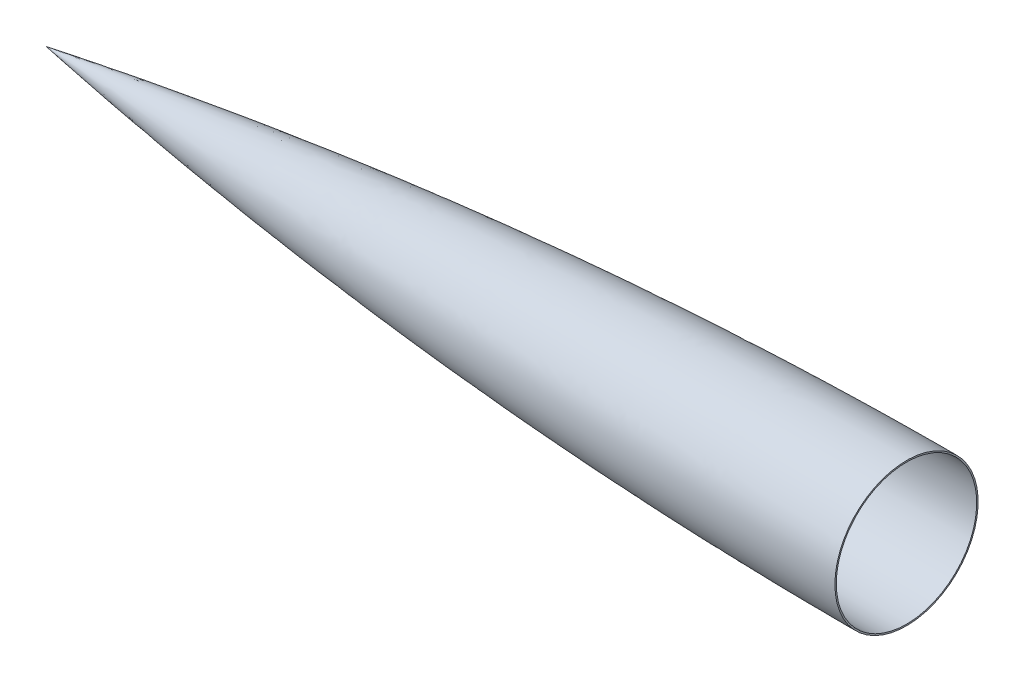
ISO-10303-21;
HEADER;
FILE_DESCRIPTION(('STEP AP214'),'2;1');
FILE_NAME('part.step','',(''),(''),'','','');
FILE_SCHEMA(('AUTOMOTIVE_DESIGN { 1 0 10303 214 1 1 1 1 }'));
ENDSEC;
DATA;
#1=APPLICATION_CONTEXT('core data for automotive mechanical design processes');
#2=APPLICATION_PROTOCOL_DEFINITION('international standard','automotive_design',2000,#1);
#3=PRODUCT_CONTEXT('',#1,'mechanical');
#4=PRODUCT('Part','Part','',(#3));
#5=PRODUCT_RELATED_PRODUCT_CATEGORY('part','',(#4));
#6=PRODUCT_DEFINITION_FORMATION('','',#4);
#7=PRODUCT_DEFINITION_CONTEXT('part definition',#1,'design');
#8=PRODUCT_DEFINITION('design','',#6,#7);
#9=PRODUCT_DEFINITION_SHAPE('','',#8);
#10=(LENGTH_UNIT() NAMED_UNIT(*) SI_UNIT(.MILLI.,.METRE.));
#11=(NAMED_UNIT(*) PLANE_ANGLE_UNIT() SI_UNIT($,.RADIAN.));
#12=(NAMED_UNIT(*) SI_UNIT($,.STERADIAN.) SOLID_ANGLE_UNIT());
#13=UNCERTAINTY_MEASURE_WITH_UNIT(LENGTH_MEASURE(1.E-05),#10,'distance_accuracy_value','');
#14=(GEOMETRIC_REPRESENTATION_CONTEXT(3) GLOBAL_UNCERTAINTY_ASSIGNED_CONTEXT((#13)) GLOBAL_UNIT_ASSIGNED_CONTEXT((#10,
#11,#12)) REPRESENTATION_CONTEXT('',''));
#15=CARTESIAN_POINT('',(0.,0.,0.));
#16=DIRECTION('',(0.,0.,1.));
#17=DIRECTION('',(1.,0.,0.));
#18=AXIS2_PLACEMENT_3D('',#15,#16,#17);
#19=CARTESIAN_POINT('',(1038.78316632407,0.,-3651.63596350947));
#20=DIRECTION('',(0.,-1.,0.));
#21=DIRECTION('',(0.,0.,1.));
#22=AXIS2_PLACEMENT_3D('',#19,#20,#21);
#23=CIRCLE('',#22,3702.58836350947);
#24=TRIMMED_CURVE('',#23,(PARAMETER_VALUE(-0.16609016004747)),
(PARAMETER_VALUE(0.16609016004747)),.T.,.PARAMETER.);
#25=CARTESIAN_POINT('',(1038.78316632407,0.,0.));
#26=DIRECTION('',(-1.,0.,0.));
#27=AXIS1_PLACEMENT('',#25,#26);
#28=SURFACE_OF_REVOLUTION('',#24,#27);
#29=CARTESIAN_POINT('',(426.643166324074,0.,0.));
#30=VERTEX_POINT('',#29);
#31=VERTEX_LOOP('',#30);
#32=FACE_BOUND('',#31,.T.);
#33=CARTESIAN_POINT('',(1038.78316632407,0.,0.));
#34=DIRECTION('',(-1.,0.,0.));
#35=DIRECTION('',(0.,0.,1.));
#36=AXIS2_PLACEMENT_3D('',#33,#34,#35);
#37=CIRCLE('',#36,50.9524);
#38=CARTESIAN_POINT('',(1038.78316632407,0.,50.9524));
#39=VERTEX_POINT('',#38);
#40=EDGE_CURVE('E11',#39,#39,#37,.T.);
#41=ORIENTED_EDGE('',*,*,#40,.T.);
#42=EDGE_LOOP('',(#41));
#43=FACE_BOUND('',#42,.T.);
#44=ADVANCED_FACE('F41',(#32,#43),#28,.T.);
#45=CARTESIAN_POINT('',(1038.78316632407,0.,0.));
#46=DIRECTION('',(-1.,0.,0.));
#47=DIRECTION('',(0.,0.,1.));
#48=AXIS2_PLACEMENT_3D('',#45,#46,#47);
#49=PLANE('',#48);
#50=CARTESIAN_POINT('',(1038.78316632407,0.,0.));
#51=DIRECTION('',(-1.,0.,0.));
#52=DIRECTION('',(0.,0.,1.));
#53=AXIS2_PLACEMENT_3D('',#50,#51,#52);
#54=CIRCLE('',#53,49.9491000000001);
#55=CARTESIAN_POINT('',(1038.78316632407,0.,49.9491000000001));
#56=VERTEX_POINT('',#55);
#57=EDGE_CURVE('E48',#56,#56,#54,.T.);
#58=ORIENTED_EDGE('',*,*,#57,.T.);
#59=EDGE_LOOP('',(#58));
#60=FACE_BOUND('',#59,.T.);
#61=ORIENTED_EDGE('',*,*,#40,.F.);
#62=EDGE_LOOP('',(#61));
#63=FACE_BOUND('',#62,.T.);
#64=ADVANCED_FACE('F57',(#60,#63),#49,.F.);
#65=CARTESIAN_POINT('',(1038.78316632407,0.,-3651.63596350947));
#66=DIRECTION('',(0.,-1.,0.));
#67=DIRECTION('',(0.,0.,1.));
#68=AXIS2_PLACEMENT_3D('',#65,#66,#67);
#69=CIRCLE('',#68,3701.58506350947);
#70=TRIMMED_CURVE('',#69,(PARAMETER_VALUE(-0.164465398033986)),
(PARAMETER_VALUE(0.164465398033986)),.T.,.PARAMETER.);
#71=CARTESIAN_POINT('',(1038.78316632407,0.,0.));
#72=DIRECTION('',(-1.,0.,0.));
#73=AXIS1_PLACEMENT('',#71,#72);
#74=SURFACE_OF_REVOLUTION('',#70,#73);
#75=CARTESIAN_POINT('',(432.741276352206,0.,0.));
#76=VERTEX_POINT('',#75);
#77=VERTEX_LOOP('',#76);
#78=FACE_BOUND('',#77,.T.);
#79=ORIENTED_EDGE('',*,*,#57,.F.);
#80=EDGE_LOOP('',(#79));
#81=FACE_BOUND('',#80,.T.);
#82=ADVANCED_FACE('F54',(#78,#81),#74,.F.);
#83=CLOSED_SHELL('',(#44,#64,#82));
#84=MANIFOLD_SOLID_BREP('B2',#83);
#85=ADVANCED_BREP_SHAPE_REPRESENTATION('',(#18,#84),#14);
#86=SHAPE_DEFINITION_REPRESENTATION(#9,#85);
ENDSEC;
END-ISO-10303-21;
